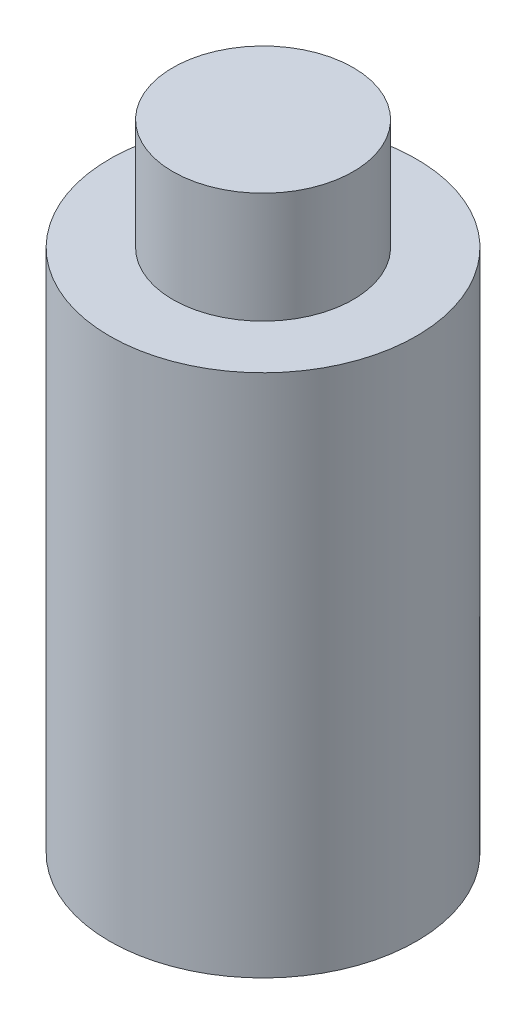
ISO-10303-21;
HEADER;
FILE_DESCRIPTION(('STEP AP214'),'2;1');
FILE_NAME('part.step','',(''),(''),'','','');
FILE_SCHEMA(('AUTOMOTIVE_DESIGN { 1 0 10303 214 1 1 1 1 }'));
ENDSEC;
DATA;
#1=APPLICATION_CONTEXT('core data for automotive mechanical design processes');
#2=APPLICATION_PROTOCOL_DEFINITION('international standard','automotive_design',2000,#1);
#3=PRODUCT_CONTEXT('',#1,'mechanical');
#4=PRODUCT('Part','Part','',(#3));
#5=PRODUCT_RELATED_PRODUCT_CATEGORY('part','',(#4));
#6=PRODUCT_DEFINITION_FORMATION('','',#4);
#7=PRODUCT_DEFINITION_CONTEXT('part definition',#1,'design');
#8=PRODUCT_DEFINITION('design','',#6,#7);
#9=PRODUCT_DEFINITION_SHAPE('','',#8);
#10=(LENGTH_UNIT() NAMED_UNIT(*) SI_UNIT(.MILLI.,.METRE.));
#11=(NAMED_UNIT(*) PLANE_ANGLE_UNIT() SI_UNIT($,.RADIAN.));
#12=(NAMED_UNIT(*) SI_UNIT($,.STERADIAN.) SOLID_ANGLE_UNIT());
#13=UNCERTAINTY_MEASURE_WITH_UNIT(LENGTH_MEASURE(1.E-05),#10,'distance_accuracy_value','');
#14=(GEOMETRIC_REPRESENTATION_CONTEXT(3) GLOBAL_UNCERTAINTY_ASSIGNED_CONTEXT((#13)) GLOBAL_UNIT_ASSIGNED_CONTEXT((#10,
#11,#12)) REPRESENTATION_CONTEXT('',''));
#15=CARTESIAN_POINT('',(0.,0.,0.));
#16=DIRECTION('',(0.,0.,1.));
#17=DIRECTION('',(1.,0.,0.));
#18=AXIS2_PLACEMENT_3D('',#15,#16,#17);
#19=CARTESIAN_POINT('',(0.,92.25,0.));
#20=DIRECTION('',(0.,-1.,0.));
#21=DIRECTION('',(0.,0.,-1.));
#22=AXIS2_PLACEMENT_3D('',#19,#20,#21);
#23=CYLINDRICAL_SURFACE('',#22,27.);
#24=CARTESIAN_POINT('',(0.,92.25,0.));
#25=DIRECTION('',(0.,1.,0.));
#26=DIRECTION('',(0.,0.,1.));
#27=AXIS2_PLACEMENT_3D('',#24,#25,#26);
#28=CIRCLE('',#27,27.);
#29=CARTESIAN_POINT('',(0.,92.25,27.));
#30=VERTEX_POINT('',#29);
#31=EDGE_CURVE('E41',#30,#30,#28,.T.);
#32=ORIENTED_EDGE('',*,*,#31,.F.);
#33=EDGE_LOOP('',(#32));
#34=FACE_BOUND('',#33,.T.);
#35=CARTESIAN_POINT('',(0.,0.,0.));
#36=DIRECTION('',(0.,1.,0.));
#37=DIRECTION('',(0.,0.,1.));
#38=AXIS2_PLACEMENT_3D('',#35,#36,#37);
#39=CIRCLE('',#38,27.);
#40=CARTESIAN_POINT('',(0.,0.,27.));
#41=VERTEX_POINT('',#40);
#42=EDGE_CURVE('E37',#41,#41,#39,.T.);
#43=ORIENTED_EDGE('',*,*,#42,.T.);
#44=EDGE_LOOP('',(#43));
#45=FACE_BOUND('',#44,.T.);
#46=ADVANCED_FACE('F34',(#34,#45),#23,.T.);
#47=CARTESIAN_POINT('',(0.,92.25,0.));
#48=DIRECTION('',(0.,1.,0.));
#49=DIRECTION('',(0.,0.,1.));
#50=AXIS2_PLACEMENT_3D('',#47,#48,#49);
#51=PLANE('',#50);
#52=CARTESIAN_POINT('',(0.,92.25,0.));
#53=DIRECTION('',(0.,1.,0.));
#54=DIRECTION('',(0.,0.,1.));
#55=AXIS2_PLACEMENT_3D('',#52,#53,#54);
#56=CIRCLE('',#55,15.875);
#57=CARTESIAN_POINT('',(0.,92.25,15.875));
#58=VERTEX_POINT('',#57);
#59=EDGE_CURVE('E10',#58,#58,#56,.T.);
#60=ORIENTED_EDGE('',*,*,#59,.F.);
#61=EDGE_LOOP('',(#60));
#62=FACE_BOUND('',#61,.T.);
#63=ORIENTED_EDGE('',*,*,#31,.T.);
#64=EDGE_LOOP('',(#63));
#65=FACE_BOUND('',#64,.T.);
#66=ADVANCED_FACE('F58',(#62,#65),#51,.T.);
#67=CARTESIAN_POINT('',(0.,0.,0.));
#68=DIRECTION('',(0.,1.,0.));
#69=DIRECTION('',(0.,0.,1.));
#70=AXIS2_PLACEMENT_3D('',#67,#68,#69);
#71=PLANE('',#70);
#72=ORIENTED_EDGE('',*,*,#42,.F.);
#73=EDGE_LOOP('',(#72));
#74=FACE_BOUND('',#73,.T.);
#75=ADVANCED_FACE('F55',(#74),#71,.F.);
#76=CARTESIAN_POINT('',(0.,111.75,0.));
#77=DIRECTION('',(0.,-1.,0.));
#78=DIRECTION('',(0.,0.,-1.));
#79=AXIS2_PLACEMENT_3D('',#76,#77,#78);
#80=CYLINDRICAL_SURFACE('',#79,15.875);
#81=CARTESIAN_POINT('',(0.,111.75,0.));
#82=DIRECTION('',(0.,1.,0.));
#83=DIRECTION('',(0.,0.,1.));
#84=AXIS2_PLACEMENT_3D('',#81,#82,#83);
#85=CIRCLE('',#84,15.875);
#86=CARTESIAN_POINT('',(0.,111.75,15.875));
#87=VERTEX_POINT('',#86);
#88=EDGE_CURVE('E47',#87,#87,#85,.T.);
#89=ORIENTED_EDGE('',*,*,#88,.F.);
#90=EDGE_LOOP('',(#89));
#91=FACE_BOUND('',#90,.T.);
#92=ORIENTED_EDGE('',*,*,#59,.T.);
#93=EDGE_LOOP('',(#92));
#94=FACE_BOUND('',#93,.T.);
#95=ADVANCED_FACE('F57',(#91,#94),#80,.T.);
#96=CARTESIAN_POINT('',(0.,111.75,0.));
#97=DIRECTION('',(0.,1.,0.));
#98=DIRECTION('',(0.,0.,1.));
#99=AXIS2_PLACEMENT_3D('',#96,#97,#98);
#100=PLANE('',#99);
#101=ORIENTED_EDGE('',*,*,#88,.T.);
#102=EDGE_LOOP('',(#101));
#103=FACE_BOUND('',#102,.T.);
#104=ADVANCED_FACE('F63',(#103),#100,.T.);
#105=CLOSED_SHELL('',(#46,#66,#75,#95,#104));
#106=MANIFOLD_SOLID_BREP('B2',#105);
#107=ADVANCED_BREP_SHAPE_REPRESENTATION('',(#18,#106),#14);
#108=SHAPE_DEFINITION_REPRESENTATION(#9,#107);
ENDSEC;
END-ISO-10303-21;
